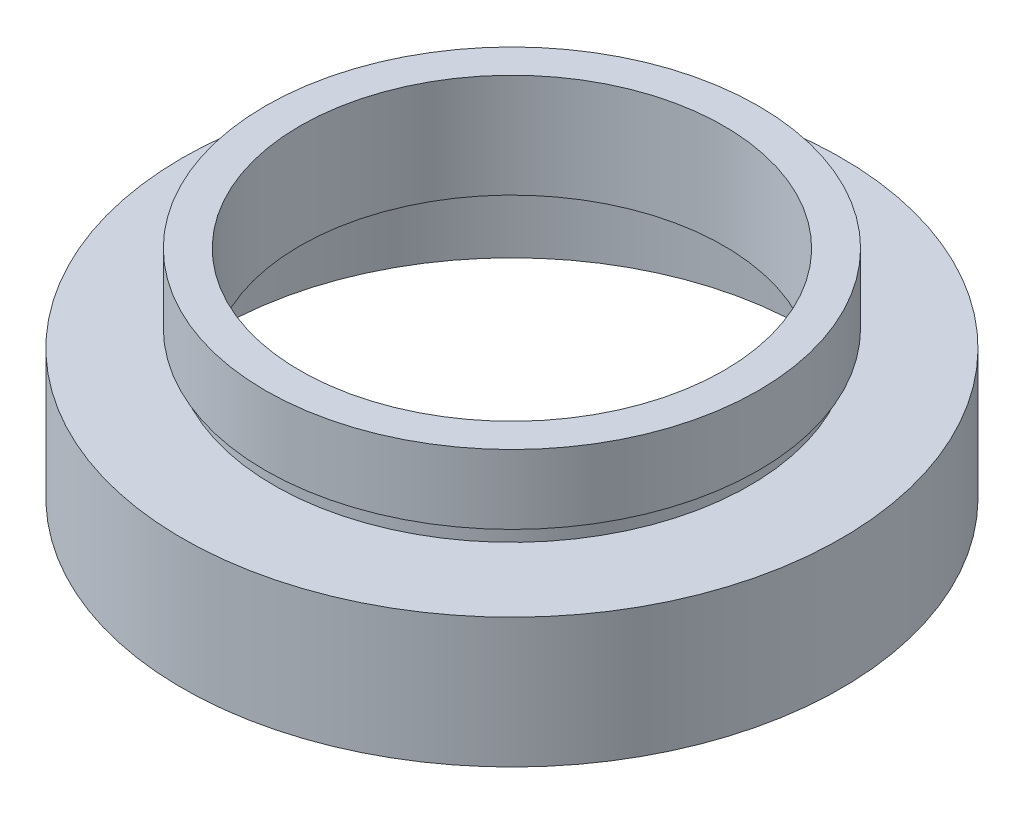
ISO-10303-21;
HEADER;
FILE_DESCRIPTION(('STEP AP214'),'2;1');
FILE_NAME('part.step','',(''),(''),'','','');
FILE_SCHEMA(('AUTOMOTIVE_DESIGN { 1 0 10303 214 1 1 1 1 }'));
ENDSEC;
DATA;
#1=APPLICATION_CONTEXT('core data for automotive mechanical design processes');
#2=APPLICATION_PROTOCOL_DEFINITION('international standard','automotive_design',2000,#1);
#3=PRODUCT_CONTEXT('',#1,'mechanical');
#4=PRODUCT('Part','Part','',(#3));
#5=PRODUCT_RELATED_PRODUCT_CATEGORY('part','',(#4));
#6=PRODUCT_DEFINITION_FORMATION('','',#4);
#7=PRODUCT_DEFINITION_CONTEXT('part definition',#1,'design');
#8=PRODUCT_DEFINITION('design','',#6,#7);
#9=PRODUCT_DEFINITION_SHAPE('','',#8);
#10=(LENGTH_UNIT() NAMED_UNIT(*) SI_UNIT(.MILLI.,.METRE.));
#11=(NAMED_UNIT(*) PLANE_ANGLE_UNIT() SI_UNIT($,.RADIAN.));
#12=(NAMED_UNIT(*) SI_UNIT($,.STERADIAN.) SOLID_ANGLE_UNIT());
#13=UNCERTAINTY_MEASURE_WITH_UNIT(LENGTH_MEASURE(1.E-05),#10,'distance_accuracy_value','');
#14=(GEOMETRIC_REPRESENTATION_CONTEXT(3) GLOBAL_UNCERTAINTY_ASSIGNED_CONTEXT((#13)) GLOBAL_UNIT_ASSIGNED_CONTEXT((#10,
#11,#12)) REPRESENTATION_CONTEXT('',''));
#15=CARTESIAN_POINT('',(0.,0.,0.));
#16=DIRECTION('',(0.,0.,1.));
#17=DIRECTION('',(1.,0.,0.));
#18=AXIS2_PLACEMENT_3D('',#15,#16,#17);
#19=CARTESIAN_POINT('',(19.05,0.,0.));
#20=DIRECTION('',(0.,1.,0.));
#21=DIRECTION('',(-1.,0.,0.));
#22=AXIS2_PLACEMENT_3D('',#19,#20,#21);
#23=PLANE('',#22);
#24=CARTESIAN_POINT('',(0.,0.,0.));
#25=DIRECTION('',(0.,1.,0.));
#26=DIRECTION('',(-1.,0.,0.));
#27=AXIS2_PLACEMENT_3D('',#24,#25,#26);
#28=CIRCLE('',#27,19.05);
#29=CARTESIAN_POINT('',(-19.05,0.,0.));
#30=VERTEX_POINT('',#29);
#31=EDGE_CURVE('E75',#30,#30,#28,.T.);
#32=ORIENTED_EDGE('',*,*,#31,.F.);
#33=EDGE_LOOP('',(#32));
#34=FACE_BOUND('',#33,.T.);
#35=CARTESIAN_POINT('',(0.,0.,0.));
#36=DIRECTION('',(0.,1.,0.));
#37=DIRECTION('',(-1.,0.,0.));
#38=AXIS2_PLACEMENT_3D('',#35,#36,#37);
#39=CIRCLE('',#38,17.);
#40=CARTESIAN_POINT('',(-17.,0.,0.));
#41=VERTEX_POINT('',#40);
#42=EDGE_CURVE('E10',#41,#41,#39,.T.);
#43=ORIENTED_EDGE('',*,*,#42,.T.);
#44=EDGE_LOOP('',(#43));
#45=FACE_BOUND('',#44,.T.);
#46=ADVANCED_FACE('F35',(#34,#45),#23,.F.);
#47=CARTESIAN_POINT('',(0.,16.8860182370821,0.));
#48=DIRECTION('',(0.,1.,0.));
#49=DIRECTION('',(-1.,0.,0.));
#50=AXIS2_PLACEMENT_3D('',#47,#48,#49);
#51=CYLINDRICAL_SURFACE('',#50,17.);
#52=ORIENTED_EDGE('',*,*,#42,.F.);
#53=EDGE_LOOP('',(#52));
#54=FACE_BOUND('',#53,.T.);
#55=CARTESIAN_POINT('',(0.,5.5,0.));
#56=DIRECTION('',(0.,1.,0.));
#57=DIRECTION('',(-1.,0.,0.));
#58=AXIS2_PLACEMENT_3D('',#55,#56,#57);
#59=CIRCLE('',#58,17.);
#60=CARTESIAN_POINT('',(-17.,5.5,0.));
#61=VERTEX_POINT('',#60);
#62=EDGE_CURVE('E41',#61,#61,#59,.T.);
#63=ORIENTED_EDGE('',*,*,#62,.T.);
#64=EDGE_LOOP('',(#63));
#65=FACE_BOUND('',#64,.T.);
#66=ADVANCED_FACE('F82',(#54,#65),#51,.F.);
#67=CARTESIAN_POINT('',(17.,5.5,0.));
#68=DIRECTION('',(0.,-1.,0.));
#69=DIRECTION('',(1.,0.,0.));
#70=AXIS2_PLACEMENT_3D('',#67,#68,#69);
#71=PLANE('',#70);
#72=ORIENTED_EDGE('',*,*,#62,.F.);
#73=EDGE_LOOP('',(#72));
#74=FACE_BOUND('',#73,.T.);
#75=CARTESIAN_POINT('',(0.,5.5,0.));
#76=DIRECTION('',(0.,1.,0.));
#77=DIRECTION('',(-1.,0.,0.));
#78=AXIS2_PLACEMENT_3D('',#75,#76,#77);
#79=CIRCLE('',#78,17.6);
#80=CARTESIAN_POINT('',(-17.6,5.49999999999999,0.));
#81=VERTEX_POINT('',#80);
#82=EDGE_CURVE('E45',#81,#81,#79,.T.);
#83=ORIENTED_EDGE('',*,*,#82,.T.);
#84=EDGE_LOOP('',(#83));
#85=FACE_BOUND('',#84,.T.);
#86=ADVANCED_FACE('F86',(#74,#85),#71,.F.);
#87=CARTESIAN_POINT('',(0.,16.8860182370821,0.));
#88=DIRECTION('',(0.,1.,0.));
#89=DIRECTION('',(-1.,0.,0.));
#90=AXIS2_PLACEMENT_3D('',#87,#88,#89);
#91=CYLINDRICAL_SURFACE('',#90,17.6);
#92=ORIENTED_EDGE('',*,*,#82,.F.);
#93=EDGE_LOOP('',(#92));
#94=FACE_BOUND('',#93,.T.);
#95=CARTESIAN_POINT('',(0.,6.5,0.));
#96=DIRECTION('',(0.,1.,0.));
#97=DIRECTION('',(-1.,0.,0.));
#98=AXIS2_PLACEMENT_3D('',#95,#96,#97);
#99=CIRCLE('',#98,17.6);
#100=CARTESIAN_POINT('',(-17.6,6.5,0.));
#101=VERTEX_POINT('',#100);
#102=EDGE_CURVE('E49',#101,#101,#99,.T.);
#103=ORIENTED_EDGE('',*,*,#102,.T.);
#104=EDGE_LOOP('',(#103));
#105=FACE_BOUND('',#104,.T.);
#106=ADVANCED_FACE('F91',(#94,#105),#91,.F.);
#107=CARTESIAN_POINT('',(12.25,6.5,0.));
#108=DIRECTION('',(0.,1.,0.));
#109=DIRECTION('',(-1.,0.,0.));
#110=AXIS2_PLACEMENT_3D('',#107,#108,#109);
#111=PLANE('',#110);
#112=ORIENTED_EDGE('',*,*,#102,.F.);
#113=EDGE_LOOP('',(#112));
#114=FACE_BOUND('',#113,.T.);
#115=CARTESIAN_POINT('',(0.,6.5,0.));
#116=DIRECTION('',(0.,1.,0.));
#117=DIRECTION('',(-1.,0.,0.));
#118=AXIS2_PLACEMENT_3D('',#115,#116,#117);
#119=CIRCLE('',#118,12.25);
#120=CARTESIAN_POINT('',(-12.25,6.5,0.));
#121=VERTEX_POINT('',#120);
#122=EDGE_CURVE('E54',#121,#121,#119,.T.);
#123=ORIENTED_EDGE('',*,*,#122,.T.);
#124=EDGE_LOOP('',(#123));
#125=FACE_BOUND('',#124,.T.);
#126=ADVANCED_FACE('F97',(#114,#125),#111,.F.);
#127=CARTESIAN_POINT('',(0.,16.8860182370821,0.));
#128=DIRECTION('',(0.,1.,0.));
#129=DIRECTION('',(-1.,0.,0.));
#130=AXIS2_PLACEMENT_3D('',#127,#128,#129);
#131=CYLINDRICAL_SURFACE('',#130,12.25);
#132=ORIENTED_EDGE('',*,*,#122,.F.);
#133=EDGE_LOOP('',(#132));
#134=FACE_BOUND('',#133,.T.);
#135=CARTESIAN_POINT('',(0.,12.5,0.));
#136=DIRECTION('',(0.,1.,0.));
#137=DIRECTION('',(-1.,0.,0.));
#138=AXIS2_PLACEMENT_3D('',#135,#136,#137);
#139=CIRCLE('',#138,12.25);
#140=CARTESIAN_POINT('',(-12.25,12.5,0.));
#141=VERTEX_POINT('',#140);
#142=EDGE_CURVE('E57',#141,#141,#139,.T.);
#143=ORIENTED_EDGE('',*,*,#142,.T.);
#144=EDGE_LOOP('',(#143));
#145=FACE_BOUND('',#144,.T.);
#146=ADVANCED_FACE('F101',(#134,#145),#131,.F.);
#147=CARTESIAN_POINT('',(12.25,12.5,0.));
#148=DIRECTION('',(0.,-1.,0.));
#149=DIRECTION('',(1.,0.,0.));
#150=AXIS2_PLACEMENT_3D('',#147,#148,#149);
#151=PLANE('',#150);
#152=ORIENTED_EDGE('',*,*,#142,.F.);
#153=EDGE_LOOP('',(#152));
#154=FACE_BOUND('',#153,.T.);
#155=CARTESIAN_POINT('',(0.,12.5,0.));
#156=DIRECTION('',(0.,1.,0.));
#157=DIRECTION('',(-1.,0.,0.));
#158=AXIS2_PLACEMENT_3D('',#155,#156,#157);
#159=CIRCLE('',#158,14.25);
#160=CARTESIAN_POINT('',(-14.25,12.5,0.));
#161=VERTEX_POINT('',#160);
#162=EDGE_CURVE('E60',#161,#161,#159,.T.);
#163=ORIENTED_EDGE('',*,*,#162,.T.);
#164=EDGE_LOOP('',(#163));
#165=FACE_BOUND('',#164,.T.);
#166=ADVANCED_FACE('F105',(#154,#165),#151,.F.);
#167=CARTESIAN_POINT('',(0.,16.8860182370821,0.));
#168=DIRECTION('',(0.,1.,0.));
#169=DIRECTION('',(-1.,0.,0.));
#170=AXIS2_PLACEMENT_3D('',#167,#168,#169);
#171=CYLINDRICAL_SURFACE('',#170,14.25);
#172=ORIENTED_EDGE('',*,*,#162,.F.);
#173=EDGE_LOOP('',(#172));
#174=FACE_BOUND('',#173,.T.);
#175=CARTESIAN_POINT('',(0.,8.5,0.));
#176=DIRECTION('',(0.,1.,0.));
#177=DIRECTION('',(-1.,0.,0.));
#178=AXIS2_PLACEMENT_3D('',#175,#176,#177);
#179=CIRCLE('',#178,14.25);
#180=CARTESIAN_POINT('',(-14.25,8.5,0.));
#181=VERTEX_POINT('',#180);
#182=EDGE_CURVE('E63',#181,#181,#179,.T.);
#183=ORIENTED_EDGE('',*,*,#182,.T.);
#184=EDGE_LOOP('',(#183));
#185=FACE_BOUND('',#184,.T.);
#186=ADVANCED_FACE('F109',(#174,#185),#171,.T.);
#187=CARTESIAN_POINT('',(14.25,8.5,0.));
#188=DIRECTION('',(0.,1.,0.));
#189=DIRECTION('',(-1.,0.,0.));
#190=AXIS2_PLACEMENT_3D('',#187,#188,#189);
#191=PLANE('',#190);
#192=ORIENTED_EDGE('',*,*,#182,.F.);
#193=EDGE_LOOP('',(#192));
#194=FACE_BOUND('',#193,.T.);
#195=CARTESIAN_POINT('',(0.,8.5,0.));
#196=DIRECTION('',(0.,1.,0.));
#197=DIRECTION('',(-1.,0.,0.));
#198=AXIS2_PLACEMENT_3D('',#195,#196,#197);
#199=CIRCLE('',#198,13.75);
#200=CARTESIAN_POINT('',(-13.75,8.5,0.));
#201=VERTEX_POINT('',#200);
#202=EDGE_CURVE('E66',#201,#201,#199,.T.);
#203=ORIENTED_EDGE('',*,*,#202,.T.);
#204=EDGE_LOOP('',(#203));
#205=FACE_BOUND('',#204,.T.);
#206=ADVANCED_FACE('F113',(#194,#205),#191,.F.);
#207=CARTESIAN_POINT('',(0.,16.8860182370821,0.));
#208=DIRECTION('',(0.,1.,0.));
#209=DIRECTION('',(-1.,0.,0.));
#210=AXIS2_PLACEMENT_3D('',#207,#208,#209);
#211=CYLINDRICAL_SURFACE('',#210,13.75);
#212=ORIENTED_EDGE('',*,*,#202,.F.);
#213=EDGE_LOOP('',(#212));
#214=FACE_BOUND('',#213,.T.);
#215=CARTESIAN_POINT('',(0.,7.5,0.));
#216=DIRECTION('',(0.,1.,0.));
#217=DIRECTION('',(-1.,0.,0.));
#218=AXIS2_PLACEMENT_3D('',#215,#216,#217);
#219=CIRCLE('',#218,13.75);
#220=CARTESIAN_POINT('',(-13.75,7.5,0.));
#221=VERTEX_POINT('',#220);
#222=EDGE_CURVE('E69',#221,#221,#219,.T.);
#223=ORIENTED_EDGE('',*,*,#222,.T.);
#224=EDGE_LOOP('',(#223));
#225=FACE_BOUND('',#224,.T.);
#226=ADVANCED_FACE('F117',(#214,#225),#211,.T.);
#227=CARTESIAN_POINT('',(13.75,7.5,0.));
#228=DIRECTION('',(0.,-1.,0.));
#229=DIRECTION('',(1.,0.,0.));
#230=AXIS2_PLACEMENT_3D('',#227,#228,#229);
#231=PLANE('',#230);
#232=ORIENTED_EDGE('',*,*,#222,.F.);
#233=EDGE_LOOP('',(#232));
#234=FACE_BOUND('',#233,.T.);
#235=CARTESIAN_POINT('',(0.,7.5,0.));
#236=DIRECTION('',(0.,1.,0.));
#237=DIRECTION('',(-1.,0.,0.));
#238=AXIS2_PLACEMENT_3D('',#235,#236,#237);
#239=CIRCLE('',#238,19.05);
#240=CARTESIAN_POINT('',(-19.05,7.5,0.));
#241=VERTEX_POINT('',#240);
#242=EDGE_CURVE('E72',#241,#241,#239,.T.);
#243=ORIENTED_EDGE('',*,*,#242,.T.);
#244=EDGE_LOOP('',(#243));
#245=FACE_BOUND('',#244,.T.);
#246=ADVANCED_FACE('F121',(#234,#245),#231,.F.);
#247=CARTESIAN_POINT('',(0.,16.8860182370821,0.));
#248=DIRECTION('',(0.,1.,0.));
#249=DIRECTION('',(-1.,0.,0.));
#250=AXIS2_PLACEMENT_3D('',#247,#248,#249);
#251=CYLINDRICAL_SURFACE('',#250,19.05);
#252=ORIENTED_EDGE('',*,*,#242,.F.);
#253=EDGE_LOOP('',(#252));
#254=FACE_BOUND('',#253,.T.);
#255=ORIENTED_EDGE('',*,*,#31,.T.);
#256=EDGE_LOOP('',(#255));
#257=FACE_BOUND('',#256,.T.);
#258=ADVANCED_FACE('F79',(#254,#257),#251,.T.);
#259=CLOSED_SHELL('',(#46,#66,#86,#106,#126,#146,#166,#186,#206,#226,#246,#258));
#260=MANIFOLD_SOLID_BREP('B2',#259);
#261=ADVANCED_BREP_SHAPE_REPRESENTATION('',(#18,#260),#14);
#262=SHAPE_DEFINITION_REPRESENTATION(#9,#261);
ENDSEC;
END-ISO-10303-21;
